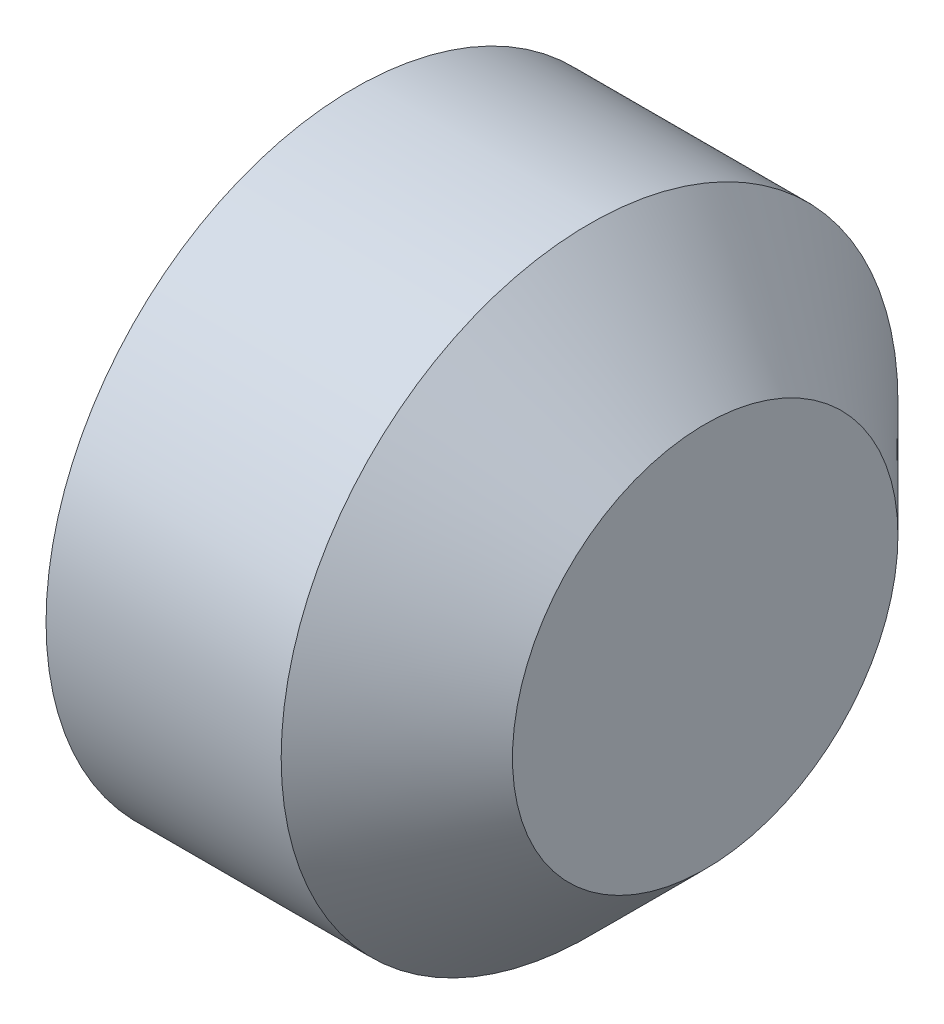
ISO-10303-21;
HEADER;
FILE_DESCRIPTION(('STEP AP214'),'2;1');
FILE_NAME('part.step','',(''),(''),'','','');
FILE_SCHEMA(('AUTOMOTIVE_DESIGN { 1 0 10303 214 1 1 1 1 }'));
ENDSEC;
DATA;
#1=APPLICATION_CONTEXT('core data for automotive mechanical design processes');
#2=APPLICATION_PROTOCOL_DEFINITION('international standard','automotive_design',2000,#1);
#3=PRODUCT_CONTEXT('',#1,'mechanical');
#4=PRODUCT('Part','Part','',(#3));
#5=PRODUCT_RELATED_PRODUCT_CATEGORY('part','',(#4));
#6=PRODUCT_DEFINITION_FORMATION('','',#4);
#7=PRODUCT_DEFINITION_CONTEXT('part definition',#1,'design');
#8=PRODUCT_DEFINITION('design','',#6,#7);
#9=PRODUCT_DEFINITION_SHAPE('','',#8);
#10=(LENGTH_UNIT() NAMED_UNIT(*) SI_UNIT(.MILLI.,.METRE.));
#11=(NAMED_UNIT(*) PLANE_ANGLE_UNIT() SI_UNIT($,.RADIAN.));
#12=(NAMED_UNIT(*) SI_UNIT($,.STERADIAN.) SOLID_ANGLE_UNIT());
#13=UNCERTAINTY_MEASURE_WITH_UNIT(LENGTH_MEASURE(1.E-05),#10,'distance_accuracy_value','');
#14=(GEOMETRIC_REPRESENTATION_CONTEXT(3) GLOBAL_UNCERTAINTY_ASSIGNED_CONTEXT((#13)) GLOBAL_UNIT_ASSIGNED_CONTEXT((#10,
#11,#12)) REPRESENTATION_CONTEXT('',''));
#15=CARTESIAN_POINT('',(0.,0.,0.));
#16=DIRECTION('',(0.,0.,1.));
#17=DIRECTION('',(1.,0.,0.));
#18=AXIS2_PLACEMENT_3D('',#15,#16,#17);
#19=CARTESIAN_POINT('',(2.5,0.,0.));
#20=DIRECTION('',(-1.,0.,0.));
#21=DIRECTION('',(0.,0.,1.));
#22=AXIS2_PLACEMENT_3D('',#19,#20,#21);
#23=CYLINDRICAL_SURFACE('',#22,2.);
#24=CARTESIAN_POINT('',(0.225166604960865,0.,0.));
#25=DIRECTION('',(-1.,0.,0.));
#26=DIRECTION('',(0.,0.,1.));
#27=AXIS2_PLACEMENT_3D('',#24,#25,#26);
#28=CIRCLE('',#27,2.);
#29=CARTESIAN_POINT('',(0.225166604960865,0.,2.));
#30=VERTEX_POINT('',#29);
#31=EDGE_CURVE('E11',#30,#30,#28,.F.);
#32=ORIENTED_EDGE('',*,*,#31,.T.);
#33=EDGE_LOOP('',(#32));
#34=FACE_BOUND('',#33,.T.);
#35=CARTESIAN_POINT('',(1.75000000007163,0.,0.));
#36=DIRECTION('',(1.,0.,0.));
#37=DIRECTION('',(0.,0.,-1.));
#38=AXIS2_PLACEMENT_3D('',#35,#36,#37);
#39=CIRCLE('',#38,2.);
#40=CARTESIAN_POINT('',(1.75000000007163,0.,-2.));
#41=VERTEX_POINT('',#40);
#42=EDGE_CURVE('E139',#41,#41,#39,.F.);
#43=ORIENTED_EDGE('',*,*,#42,.T.);
#44=EDGE_LOOP('',(#43));
#45=FACE_BOUND('',#44,.T.);
#46=ADVANCED_FACE('F37',(#34,#45),#23,.T.);
#47=CARTESIAN_POINT('',(2.5,2.,0.));
#48=DIRECTION('',(1.,0.,0.));
#49=DIRECTION('',(0.,0.,-1.));
#50=AXIS2_PLACEMENT_3D('',#47,#48,#49);
#51=PLANE('',#50);
#52=CARTESIAN_POINT('',(2.5,0.,0.));
#53=DIRECTION('',(1.,0.,0.));
#54=DIRECTION('',(0.,0.,-1.));
#55=AXIS2_PLACEMENT_3D('',#52,#53,#54);
#56=CIRCLE('',#55,1.25000000001478);
#57=CARTESIAN_POINT('',(2.5,0.,-1.25000000001478));
#58=VERTEX_POINT('',#57);
#59=EDGE_CURVE('E147',#58,#58,#56,.T.);
#60=ORIENTED_EDGE('',*,*,#59,.T.);
#61=EDGE_LOOP('',(#60));
#62=FACE_BOUND('',#61,.T.);
#63=ADVANCED_FACE('F164',(#62),#51,.T.);
#64=CARTESIAN_POINT('',(0.,0.,0.));
#65=DIRECTION('',(-1.,0.,0.));
#66=DIRECTION('',(0.,0.,1.));
#67=AXIS2_PLACEMENT_3D('',#64,#65,#66);
#68=PLANE('',#67);
#69=CARTESIAN_POINT('',(0.,0.,0.));
#70=DIRECTION('',(-1.,0.,0.));
#71=DIRECTION('',(0.,0.,1.));
#72=AXIS2_PLACEMENT_3D('',#69,#70,#71);
#73=CIRCLE('',#72,1.61000000001453);
#74=CARTESIAN_POINT('',(0.,0.,1.61000000001453));
#75=VERTEX_POINT('',#74);
#76=EDGE_CURVE('E45',#75,#75,#73,.T.);
#77=ORIENTED_EDGE('',*,*,#76,.T.);
#78=EDGE_LOOP('',(#77));
#79=FACE_BOUND('',#78,.T.);
#80=DIRECTION('',(0.,0.866025403784439,0.5));
#81=VECTOR('',#80,1.);
#82=CARTESIAN_POINT('',(0.,-0.999999999999997,0.577350269189623));
#83=LINE('',#82,#81);
#84=CARTESIAN_POINT('',(0.,-0.999999999999997,0.577350269189623));
#85=VERTEX_POINT('',#84);
#86=CARTESIAN_POINT('',(0.,0.,1.15470053837925));
#87=VERTEX_POINT('',#86);
#88=EDGE_CURVE('E52',#85,#87,#83,.T.);
#89=ORIENTED_EDGE('',*,*,#88,.F.);
#90=DIRECTION('',(0.,0.,1.));
#91=VECTOR('',#90,1.);
#92=CARTESIAN_POINT('',(0.,-0.999999999999997,-0.577350269189628));
#93=LINE('',#92,#91);
#94=CARTESIAN_POINT('',(0.,-0.999999999999997,-0.577350269189628));
#95=VERTEX_POINT('',#94);
#96=EDGE_CURVE('E135',#95,#85,#93,.T.);
#97=ORIENTED_EDGE('',*,*,#96,.F.);
#98=DIRECTION('',(0.,-0.866025403784439,0.5));
#99=VECTOR('',#98,1.);
#100=CARTESIAN_POINT('',(0.,0.,-1.15470053837925));
#101=LINE('',#100,#99);
#102=CARTESIAN_POINT('',(0.,0.,-1.15470053837925));
#103=VERTEX_POINT('',#102);
#104=EDGE_CURVE('E133',#103,#95,#101,.T.);
#105=ORIENTED_EDGE('',*,*,#104,.F.);
#106=DIRECTION('',(0.,-0.866025403784438,-0.5));
#107=VECTOR('',#106,1.);
#108=CARTESIAN_POINT('',(0.,1.,-0.577350269189628));
#109=LINE('',#108,#107);
#110=CARTESIAN_POINT('',(0.,1.,-0.577350269189628));
#111=VERTEX_POINT('',#110);
#112=EDGE_CURVE('E100',#111,#103,#109,.T.);
#113=ORIENTED_EDGE('',*,*,#112,.F.);
#114=DIRECTION('',(0.,0.,-1.));
#115=VECTOR('',#114,1.);
#116=CARTESIAN_POINT('',(0.,1.,0.577350269189624));
#117=LINE('',#116,#115);
#118=CARTESIAN_POINT('',(0.,1.,0.577350269189624));
#119=VERTEX_POINT('',#118);
#120=EDGE_CURVE('E129',#119,#111,#117,.T.);
#121=ORIENTED_EDGE('',*,*,#120,.F.);
#122=DIRECTION('',(0.,0.866025403784439,-0.5));
#123=VECTOR('',#122,1.);
#124=CARTESIAN_POINT('',(0.,0.,1.15470053837925));
#125=LINE('',#124,#123);
#126=EDGE_CURVE('E126',#87,#119,#125,.T.);
#127=ORIENTED_EDGE('',*,*,#126,.F.);
#128=EDGE_LOOP('',(#89,#97,#105,#113,#121,#127));
#129=FACE_BOUND('',#128,.T.);
#130=ADVANCED_FACE('F152',(#79,#129),#68,.T.);
#131=CARTESIAN_POINT('',(1.5,-0.999999999999997,0.577350269189623));
#132=DIRECTION('',(0.,-0.5,0.866025403784439));
#133=DIRECTION('',(0.,-0.866025403784439,-0.5));
#134=AXIS2_PLACEMENT_3D('',#131,#132,#133);
#135=PLANE('',#134);
#136=ORIENTED_EDGE('',*,*,#88,.T.);
#137=DIRECTION('',(-1.,0.,0.));
#138=VECTOR('',#137,1.);
#139=CARTESIAN_POINT('',(1.5,0.,1.15470053837925));
#140=LINE('',#139,#138);
#141=CARTESIAN_POINT('',(1.5,0.,1.15470053837925));
#142=VERTEX_POINT('',#141);
#143=EDGE_CURVE('E82',#142,#87,#140,.T.);
#144=ORIENTED_EDGE('',*,*,#143,.F.);
#145=DIRECTION('',(0.,0.866025403784439,0.5));
#146=VECTOR('',#145,1.);
#147=CARTESIAN_POINT('',(1.5,-0.999999999999997,0.577350269189623));
#148=LINE('',#147,#146);
#149=CARTESIAN_POINT('',(1.5,-0.999999999999997,0.577350269189623));
#150=VERTEX_POINT('',#149);
#151=EDGE_CURVE('E137',#150,#142,#148,.T.);
#152=ORIENTED_EDGE('',*,*,#151,.F.);
#153=DIRECTION('',(-1.,0.,0.));
#154=VECTOR('',#153,1.);
#155=CARTESIAN_POINT('',(1.5,-0.999999999999997,0.577350269189623));
#156=LINE('',#155,#154);
#157=EDGE_CURVE('E60',#150,#85,#156,.T.);
#158=ORIENTED_EDGE('',*,*,#157,.T.);
#159=EDGE_LOOP('',(#136,#144,#152,#158));
#160=FACE_BOUND('',#159,.T.);
#161=ADVANCED_FACE('F176',(#160),#135,.F.);
#162=CARTESIAN_POINT('',(1.5,-0.999999999999997,-0.577350269189628));
#163=DIRECTION('',(0.,-1.,0.));
#164=DIRECTION('',(0.,0.,-1.));
#165=AXIS2_PLACEMENT_3D('',#162,#163,#164);
#166=PLANE('',#165);
#167=ORIENTED_EDGE('',*,*,#96,.T.);
#168=ORIENTED_EDGE('',*,*,#157,.F.);
#169=DIRECTION('',(0.,0.,1.));
#170=VECTOR('',#169,1.);
#171=CARTESIAN_POINT('',(1.5,-0.999999999999997,-0.577350269189628));
#172=LINE('',#171,#170);
#173=CARTESIAN_POINT('',(1.5,-0.999999999999997,-0.577350269189628));
#174=VERTEX_POINT('',#173);
#175=EDGE_CURVE('E112',#174,#150,#172,.T.);
#176=ORIENTED_EDGE('',*,*,#175,.F.);
#177=DIRECTION('',(-1.,0.,0.));
#178=VECTOR('',#177,1.);
#179=CARTESIAN_POINT('',(1.5,-0.999999999999997,-0.577350269189628));
#180=LINE('',#179,#178);
#181=EDGE_CURVE('E104',#174,#95,#180,.T.);
#182=ORIENTED_EDGE('',*,*,#181,.T.);
#183=EDGE_LOOP('',(#167,#168,#176,#182));
#184=FACE_BOUND('',#183,.T.);
#185=ADVANCED_FACE('F179',(#184),#166,.F.);
#186=CARTESIAN_POINT('',(1.5,0.,-1.15470053837925));
#187=DIRECTION('',(0.,-0.5,-0.866025403784439));
#188=DIRECTION('',(0.,0.866025403784439,-0.5));
#189=AXIS2_PLACEMENT_3D('',#186,#187,#188);
#190=PLANE('',#189);
#191=ORIENTED_EDGE('',*,*,#104,.T.);
#192=ORIENTED_EDGE('',*,*,#181,.F.);
#193=DIRECTION('',(0.,-0.866025403784439,0.5));
#194=VECTOR('',#193,1.);
#195=CARTESIAN_POINT('',(1.5,0.,-1.15470053837925));
#196=LINE('',#195,#194);
#197=CARTESIAN_POINT('',(1.5,0.,-1.15470053837925));
#198=VERTEX_POINT('',#197);
#199=EDGE_CURVE('E108',#198,#174,#196,.T.);
#200=ORIENTED_EDGE('',*,*,#199,.F.);
#201=DIRECTION('',(-1.,0.,0.));
#202=VECTOR('',#201,1.);
#203=CARTESIAN_POINT('',(1.5,0.,-1.15470053837925));
#204=LINE('',#203,#202);
#205=EDGE_CURVE('E93',#198,#103,#204,.T.);
#206=ORIENTED_EDGE('',*,*,#205,.T.);
#207=EDGE_LOOP('',(#191,#192,#200,#206));
#208=FACE_BOUND('',#207,.T.);
#209=ADVANCED_FACE('F109',(#208),#190,.F.);
#210=CARTESIAN_POINT('',(1.5,1.,-0.577350269189628));
#211=DIRECTION('',(0.,0.5,-0.866025403784438));
#212=DIRECTION('',(0.,0.866025403784439,0.5));
#213=AXIS2_PLACEMENT_3D('',#210,#211,#212);
#214=PLANE('',#213);
#215=ORIENTED_EDGE('',*,*,#112,.T.);
#216=ORIENTED_EDGE('',*,*,#205,.F.);
#217=DIRECTION('',(0.,-0.866025403784438,-0.5));
#218=VECTOR('',#217,1.);
#219=CARTESIAN_POINT('',(1.5,1.,-0.577350269189628));
#220=LINE('',#219,#218);
#221=CARTESIAN_POINT('',(1.5,1.,-0.577350269189628));
#222=VERTEX_POINT('',#221);
#223=EDGE_CURVE('E97',#222,#198,#220,.T.);
#224=ORIENTED_EDGE('',*,*,#223,.F.);
#225=DIRECTION('',(-1.,0.,0.));
#226=VECTOR('',#225,1.);
#227=CARTESIAN_POINT('',(1.5,1.,-0.577350269189628));
#228=LINE('',#227,#226);
#229=EDGE_CURVE('E105',#222,#111,#228,.T.);
#230=ORIENTED_EDGE('',*,*,#229,.T.);
#231=EDGE_LOOP('',(#215,#216,#224,#230));
#232=FACE_BOUND('',#231,.T.);
#233=ADVANCED_FACE('F95',(#232),#214,.F.);
#234=CARTESIAN_POINT('',(1.5,1.,0.577350269189624));
#235=DIRECTION('',(0.,1.,0.));
#236=DIRECTION('',(0.,0.,1.));
#237=AXIS2_PLACEMENT_3D('',#234,#235,#236);
#238=PLANE('',#237);
#239=ORIENTED_EDGE('',*,*,#120,.T.);
#240=ORIENTED_EDGE('',*,*,#229,.F.);
#241=DIRECTION('',(0.,0.,-1.));
#242=VECTOR('',#241,1.);
#243=CARTESIAN_POINT('',(1.5,1.,0.577350269189624));
#244=LINE('',#243,#242);
#245=CARTESIAN_POINT('',(1.5,1.,0.577350269189624));
#246=VERTEX_POINT('',#245);
#247=EDGE_CURVE('E118',#246,#222,#244,.T.);
#248=ORIENTED_EDGE('',*,*,#247,.F.);
#249=DIRECTION('',(-1.,0.,0.));
#250=VECTOR('',#249,1.);
#251=CARTESIAN_POINT('',(1.5,1.,0.577350269189624));
#252=LINE('',#251,#250);
#253=EDGE_CURVE('E142',#246,#119,#252,.T.);
#254=ORIENTED_EDGE('',*,*,#253,.T.);
#255=EDGE_LOOP('',(#239,#240,#248,#254));
#256=FACE_BOUND('',#255,.T.);
#257=ADVANCED_FACE('F183',(#256),#238,.F.);
#258=CARTESIAN_POINT('',(1.5,0.,1.15470053837925));
#259=DIRECTION('',(0.,0.5,0.866025403784439));
#260=DIRECTION('',(0.,-0.866025403784439,0.5));
#261=AXIS2_PLACEMENT_3D('',#258,#259,#260);
#262=PLANE('',#261);
#263=ORIENTED_EDGE('',*,*,#126,.T.);
#264=ORIENTED_EDGE('',*,*,#253,.F.);
#265=DIRECTION('',(0.,0.866025403784439,-0.5));
#266=VECTOR('',#265,1.);
#267=CARTESIAN_POINT('',(1.5,0.,1.15470053837925));
#268=LINE('',#267,#266);
#269=EDGE_CURVE('E120',#142,#246,#268,.T.);
#270=ORIENTED_EDGE('',*,*,#269,.F.);
#271=ORIENTED_EDGE('',*,*,#143,.T.);
#272=EDGE_LOOP('',(#263,#264,#270,#271));
#273=FACE_BOUND('',#272,.T.);
#274=ADVANCED_FACE('F180',(#273),#262,.F.);
#275=CARTESIAN_POINT('',(1.5,0.,0.));
#276=DIRECTION('',(-1.,0.,0.));
#277=DIRECTION('',(0.,0.,1.));
#278=AXIS2_PLACEMENT_3D('',#275,#276,#277);
#279=PLANE('',#278);
#280=ORIENTED_EDGE('',*,*,#151,.T.);
#281=ORIENTED_EDGE('',*,*,#269,.T.);
#282=ORIENTED_EDGE('',*,*,#247,.T.);
#283=ORIENTED_EDGE('',*,*,#223,.T.);
#284=ORIENTED_EDGE('',*,*,#199,.T.);
#285=ORIENTED_EDGE('',*,*,#175,.T.);
#286=EDGE_LOOP('',(#280,#281,#282,#283,#284,#285));
#287=FACE_BOUND('',#286,.T.);
#288=ADVANCED_FACE('F115',(#287),#279,.T.);
#289=CARTESIAN_POINT('',(1.75000000007163,0.,0.));
#290=DIRECTION('',(-1.,0.,0.));
#291=DIRECTION('',(0.,0.,1.));
#292=AXIS2_PLACEMENT_3D('',#289,#290,#291);
#293=CONICAL_SURFACE('',#292,2.,0.785398163435347);
#294=ORIENTED_EDGE('',*,*,#59,.F.);
#295=EDGE_LOOP('',(#294));
#296=FACE_BOUND('',#295,.T.);
#297=ORIENTED_EDGE('',*,*,#42,.F.);
#298=EDGE_LOOP('',(#297));
#299=FACE_BOUND('',#298,.T.);
#300=ADVANCED_FACE('F156',(#296,#299),#293,.T.);
#301=CARTESIAN_POINT('',(0.,0.,0.));
#302=DIRECTION('',(1.,0.,0.));
#303=DIRECTION('',(0.,0.,-1.));
#304=AXIS2_PLACEMENT_3D('',#301,#302,#303);
#305=CONICAL_SURFACE('',#304,1.61000000001453,1.04719755122486);
#306=ORIENTED_EDGE('',*,*,#31,.F.);
#307=EDGE_LOOP('',(#306));
#308=FACE_BOUND('',#307,.T.);
#309=ORIENTED_EDGE('',*,*,#76,.F.);
#310=EDGE_LOOP('',(#309));
#311=FACE_BOUND('',#310,.T.);
#312=ADVANCED_FACE('F39',(#308,#311),#305,.T.);
#313=CLOSED_SHELL('',(#46,#63,#130,#161,#185,#209,#233,#257,#274,#288,#300,#312));
#314=MANIFOLD_SOLID_BREP('B2',#313);
#315=ADVANCED_BREP_SHAPE_REPRESENTATION('',(#18,#314),#14);
#316=SHAPE_DEFINITION_REPRESENTATION(#9,#315);
ENDSEC;
END-ISO-10303-21;
